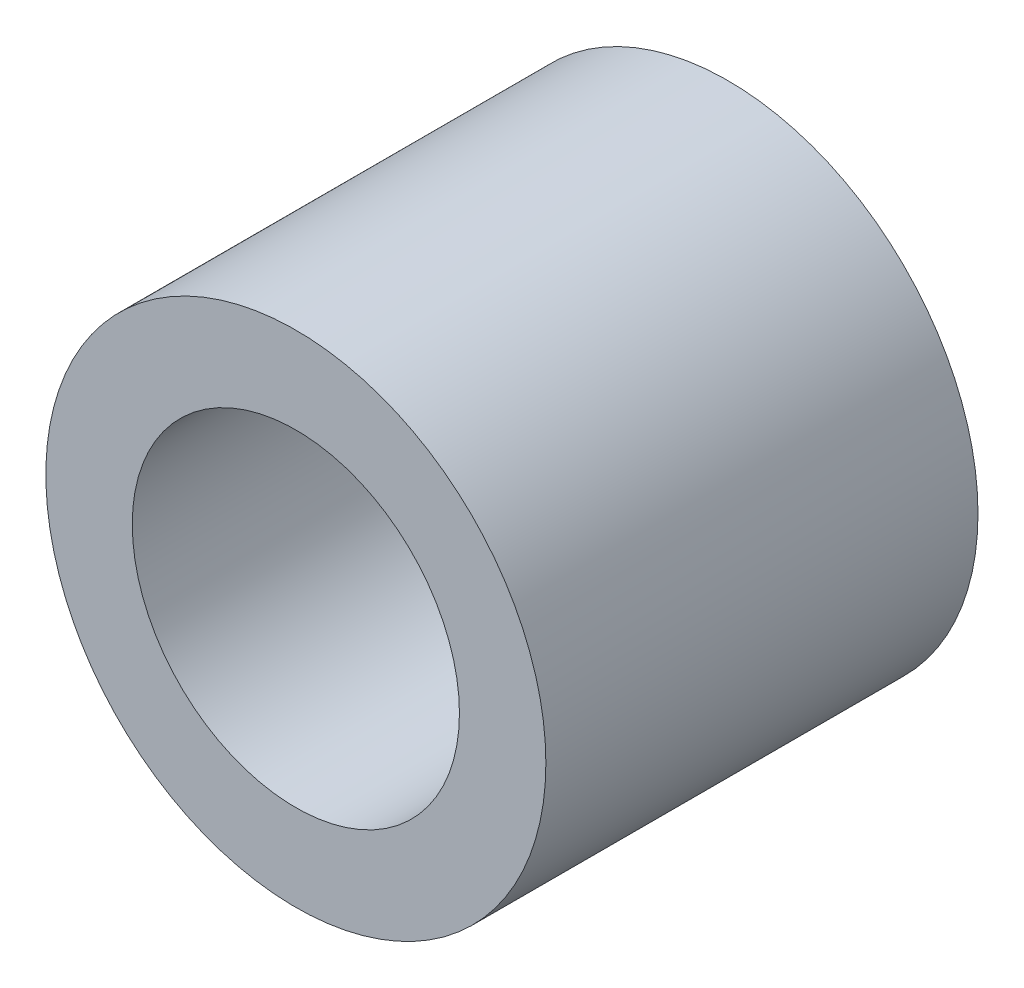
ISO-10303-21;
HEADER;
FILE_DESCRIPTION(('STEP AP214'),'2;1');
FILE_NAME('part.step','',(''),(''),'','','');
FILE_SCHEMA(('AUTOMOTIVE_DESIGN { 1 0 10303 214 1 1 1 1 }'));
ENDSEC;
DATA;
#1=APPLICATION_CONTEXT('core data for automotive mechanical design processes');
#2=APPLICATION_PROTOCOL_DEFINITION('international standard','automotive_design',2000,#1);
#3=PRODUCT_CONTEXT('',#1,'mechanical');
#4=PRODUCT('Part','Part','',(#3));
#5=PRODUCT_RELATED_PRODUCT_CATEGORY('part','',(#4));
#6=PRODUCT_DEFINITION_FORMATION('','',#4);
#7=PRODUCT_DEFINITION_CONTEXT('part definition',#1,'design');
#8=PRODUCT_DEFINITION('design','',#6,#7);
#9=PRODUCT_DEFINITION_SHAPE('','',#8);
#10=(LENGTH_UNIT() NAMED_UNIT(*) SI_UNIT(.MILLI.,.METRE.));
#11=(NAMED_UNIT(*) PLANE_ANGLE_UNIT() SI_UNIT($,.RADIAN.));
#12=(NAMED_UNIT(*) SI_UNIT($,.STERADIAN.) SOLID_ANGLE_UNIT());
#13=UNCERTAINTY_MEASURE_WITH_UNIT(LENGTH_MEASURE(1.E-05),#10,'distance_accuracy_value','');
#14=(GEOMETRIC_REPRESENTATION_CONTEXT(3) GLOBAL_UNCERTAINTY_ASSIGNED_CONTEXT((#13)) GLOBAL_UNIT_ASSIGNED_CONTEXT((#10,
#11,#12)) REPRESENTATION_CONTEXT('',''));
#15=CARTESIAN_POINT('',(0.,0.,0.));
#16=DIRECTION('',(0.,0.,1.));
#17=DIRECTION('',(1.,0.,0.));
#18=AXIS2_PLACEMENT_3D('',#15,#16,#17);
#19=CARTESIAN_POINT('',(0.,0.,7.));
#20=DIRECTION('',(0.,0.,-1.));
#21=DIRECTION('',(-1.,0.,0.));
#22=AXIS2_PLACEMENT_3D('',#19,#20,#21);
#23=CYLINDRICAL_SURFACE('',#22,4.05);
#24=CARTESIAN_POINT('',(0.,0.,7.));
#25=DIRECTION('',(0.,0.,1.));
#26=DIRECTION('',(1.,0.,0.));
#27=AXIS2_PLACEMENT_3D('',#24,#25,#26);
#28=CIRCLE('',#27,4.05);
#29=CARTESIAN_POINT('',(4.05,0.,7.));
#30=VERTEX_POINT('',#29);
#31=EDGE_CURVE('E10',#30,#30,#28,.T.);
#32=ORIENTED_EDGE('',*,*,#31,.F.);
#33=EDGE_LOOP('',(#32));
#34=FACE_BOUND('',#33,.T.);
#35=CARTESIAN_POINT('',(0.,0.,0.));
#36=DIRECTION('',(0.,0.,1.));
#37=DIRECTION('',(1.,0.,0.));
#38=AXIS2_PLACEMENT_3D('',#35,#36,#37);
#39=CIRCLE('',#38,4.05);
#40=CARTESIAN_POINT('',(4.05,0.,0.));
#41=VERTEX_POINT('',#40);
#42=EDGE_CURVE('E46',#41,#41,#39,.T.);
#43=ORIENTED_EDGE('',*,*,#42,.T.);
#44=EDGE_LOOP('',(#43));
#45=FACE_BOUND('',#44,.T.);
#46=ADVANCED_FACE('F43',(#34,#45),#23,.T.);
#47=CARTESIAN_POINT('',(0.,0.,7.));
#48=DIRECTION('',(0.,0.,1.));
#49=DIRECTION('',(1.,0.,0.));
#50=AXIS2_PLACEMENT_3D('',#47,#48,#49);
#51=PLANE('',#50);
#52=CARTESIAN_POINT('',(0.,0.,7.));
#53=DIRECTION('',(0.,0.,1.));
#54=DIRECTION('',(1.,0.,0.));
#55=AXIS2_PLACEMENT_3D('',#52,#53,#54);
#56=CIRCLE('',#55,2.65);
#57=CARTESIAN_POINT('',(2.65,0.,7.));
#58=VERTEX_POINT('',#57);
#59=EDGE_CURVE('E60',#58,#58,#56,.T.);
#60=ORIENTED_EDGE('',*,*,#59,.F.);
#61=EDGE_LOOP('',(#60));
#62=FACE_BOUND('',#61,.T.);
#63=ORIENTED_EDGE('',*,*,#31,.T.);
#64=EDGE_LOOP('',(#63));
#65=FACE_BOUND('',#64,.T.);
#66=ADVANCED_FACE('F67',(#62,#65),#51,.T.);
#67=CARTESIAN_POINT('',(0.,0.,0.));
#68=DIRECTION('',(0.,0.,1.));
#69=DIRECTION('',(1.,0.,0.));
#70=AXIS2_PLACEMENT_3D('',#67,#68,#69);
#71=PLANE('',#70);
#72=CARTESIAN_POINT('',(0.,0.,0.));
#73=DIRECTION('',(0.,0.,1.));
#74=DIRECTION('',(1.,0.,0.));
#75=AXIS2_PLACEMENT_3D('',#72,#73,#74);
#76=CIRCLE('',#75,2.65);
#77=CARTESIAN_POINT('',(2.65,0.,0.));
#78=VERTEX_POINT('',#77);
#79=EDGE_CURVE('E55',#78,#78,#76,.T.);
#80=ORIENTED_EDGE('',*,*,#79,.T.);
#81=EDGE_LOOP('',(#80));
#82=FACE_BOUND('',#81,.T.);
#83=ORIENTED_EDGE('',*,*,#42,.F.);
#84=EDGE_LOOP('',(#83));
#85=FACE_BOUND('',#84,.T.);
#86=ADVANCED_FACE('F69',(#82,#85),#71,.F.);
#87=CARTESIAN_POINT('',(0.,0.,7.));
#88=DIRECTION('',(0.,0.,1.));
#89=DIRECTION('',(1.,0.,0.));
#90=AXIS2_PLACEMENT_3D('',#87,#88,#89);
#91=CYLINDRICAL_SURFACE('',#90,2.65);
#92=ORIENTED_EDGE('',*,*,#79,.F.);
#93=EDGE_LOOP('',(#92));
#94=FACE_BOUND('',#93,.T.);
#95=ORIENTED_EDGE('',*,*,#59,.T.);
#96=EDGE_LOOP('',(#95));
#97=FACE_BOUND('',#96,.T.);
#98=ADVANCED_FACE('F65',(#94,#97),#91,.F.);
#99=CLOSED_SHELL('',(#46,#66,#86,#98));
#100=MANIFOLD_SOLID_BREP('B2',#99);
#101=ADVANCED_BREP_SHAPE_REPRESENTATION('',(#18,#100),#14);
#102=SHAPE_DEFINITION_REPRESENTATION(#9,#101);
ENDSEC;
END-ISO-10303-21;
